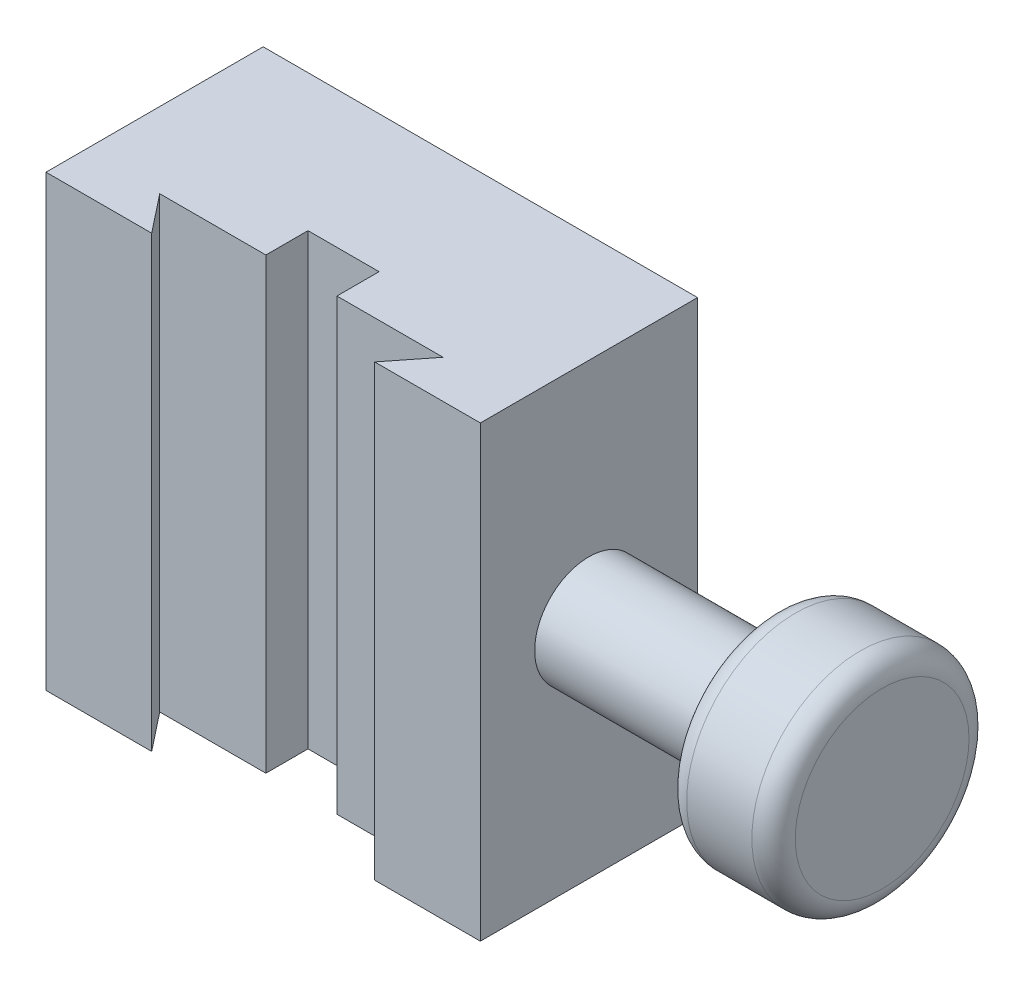
ISO-10303-21;
HEADER;
FILE_DESCRIPTION(('STEP AP214'),'2;1');
FILE_NAME('part.step','',(''),(''),'','','');
FILE_SCHEMA(('AUTOMOTIVE_DESIGN { 1 0 10303 214 1 1 1 1 }'));
ENDSEC;
DATA;
#1=APPLICATION_CONTEXT('core data for automotive mechanical design processes');
#2=APPLICATION_PROTOCOL_DEFINITION('international standard','automotive_design',2000,#1);
#3=PRODUCT_CONTEXT('',#1,'mechanical');
#4=PRODUCT('Part','Part','',(#3));
#5=PRODUCT_RELATED_PRODUCT_CATEGORY('part','',(#4));
#6=PRODUCT_DEFINITION_FORMATION('','',#4);
#7=PRODUCT_DEFINITION_CONTEXT('part definition',#1,'design');
#8=PRODUCT_DEFINITION('design','',#6,#7);
#9=PRODUCT_DEFINITION_SHAPE('','',#8);
#10=(LENGTH_UNIT() NAMED_UNIT(*) SI_UNIT(.MILLI.,.METRE.));
#11=(NAMED_UNIT(*) PLANE_ANGLE_UNIT() SI_UNIT($,.RADIAN.));
#12=(NAMED_UNIT(*) SI_UNIT($,.STERADIAN.) SOLID_ANGLE_UNIT());
#13=UNCERTAINTY_MEASURE_WITH_UNIT(LENGTH_MEASURE(1.E-05),#10,'distance_accuracy_value','');
#14=(GEOMETRIC_REPRESENTATION_CONTEXT(3) GLOBAL_UNCERTAINTY_ASSIGNED_CONTEXT((#13)) GLOBAL_UNIT_ASSIGNED_CONTEXT((#10,
#11,#12)) REPRESENTATION_CONTEXT('',''));
#15=CARTESIAN_POINT('',(0.,0.,0.));
#16=DIRECTION('',(0.,0.,1.));
#17=DIRECTION('',(1.,0.,0.));
#18=AXIS2_PLACEMENT_3D('',#15,#16,#17);
#19=CARTESIAN_POINT('',(0.,0.,30.));
#20=DIRECTION('',(0.,0.,1.));
#21=DIRECTION('',(1.,0.,0.));
#22=AXIS2_PLACEMENT_3D('',#19,#20,#21);
#23=PLANE('',#22);
#24=DIRECTION('',(0.,-1.,0.));
#25=VECTOR('',#24,1.);
#26=CARTESIAN_POINT('',(-15.4,31.,30.));
#27=LINE('',#26,#25);
#28=CARTESIAN_POINT('',(-15.4,31.,30.));
#29=VERTEX_POINT('',#28);
#30=CARTESIAN_POINT('',(-15.4,-31.,30.));
#31=VERTEX_POINT('',#30);
#32=EDGE_CURVE('E216',#29,#31,#27,.T.);
#33=ORIENTED_EDGE('',*,*,#32,.F.);
#34=DIRECTION('',(1.,0.,0.));
#35=VECTOR('',#34,1.);
#36=CARTESIAN_POINT('',(-30.,31.,30.));
#37=LINE('',#36,#35);
#38=CARTESIAN_POINT('',(-30.,31.,30.));
#39=VERTEX_POINT('',#38);
#40=EDGE_CURVE('E286',#39,#29,#37,.T.);
#41=ORIENTED_EDGE('',*,*,#40,.F.);
#42=DIRECTION('',(0.,1.,0.));
#43=VECTOR('',#42,1.);
#44=CARTESIAN_POINT('',(-30.,-31.,30.));
#45=LINE('',#44,#43);
#46=CARTESIAN_POINT('',(-30.,-31.,30.));
#47=VERTEX_POINT('',#46);
#48=EDGE_CURVE('E294',#47,#39,#45,.T.);
#49=ORIENTED_EDGE('',*,*,#48,.F.);
#50=DIRECTION('',(1.,0.,0.));
#51=VECTOR('',#50,1.);
#52=CARTESIAN_POINT('',(-30.,-31.,30.));
#53=LINE('',#52,#51);
#54=EDGE_CURVE('E291',#47,#31,#53,.T.);
#55=ORIENTED_EDGE('',*,*,#54,.T.);
#56=EDGE_LOOP('',(#33,#41,#49,#55));
#57=FACE_BOUND('',#56,.T.);
#58=ADVANCED_FACE('F36',(#57),#23,.T.);
#59=CARTESIAN_POINT('',(-30.,31.,30.));
#60=DIRECTION('',(0.,1.,0.));
#61=DIRECTION('',(0.,0.,1.));
#62=AXIS2_PLACEMENT_3D('',#59,#60,#61);
#63=PLANE('',#62);
#64=DIRECTION('',(-0.619788850318609,0.,-0.784768616230757));
#65=VECTOR('',#64,1.);
#66=CARTESIAN_POINT('',(-19.57,31.,24.72));
#67=LINE('',#66,#65);
#68=CARTESIAN_POINT('',(-19.57,31.,24.72));
#69=VERTEX_POINT('',#68);
#70=EDGE_CURVE('E196',#29,#69,#67,.T.);
#71=ORIENTED_EDGE('',*,*,#70,.T.);
#72=DIRECTION('',(1.,0.,0.));
#73=VECTOR('',#72,1.);
#74=CARTESIAN_POINT('',(-4.91,31.,24.72));
#75=LINE('',#74,#73);
#76=CARTESIAN_POINT('',(-4.91,31.,24.72));
#77=VERTEX_POINT('',#76);
#78=EDGE_CURVE('E172',#69,#77,#75,.T.);
#79=ORIENTED_EDGE('',*,*,#78,.T.);
#80=DIRECTION('',(0.,0.,-1.));
#81=VECTOR('',#80,1.);
#82=CARTESIAN_POINT('',(-4.91,31.,24.72));
#83=LINE('',#82,#81);
#84=CARTESIAN_POINT('',(-4.91,31.,18.9));
#85=VERTEX_POINT('',#84);
#86=EDGE_CURVE('E164',#77,#85,#83,.T.);
#87=ORIENTED_EDGE('',*,*,#86,.T.);
#88=DIRECTION('',(1.,0.,0.));
#89=VECTOR('',#88,1.);
#90=CARTESIAN_POINT('',(4.91,31.,18.9));
#91=LINE('',#90,#89);
#92=CARTESIAN_POINT('',(4.91,31.,18.9));
#93=VERTEX_POINT('',#92);
#94=EDGE_CURVE('E175',#85,#93,#91,.T.);
#95=ORIENTED_EDGE('',*,*,#94,.T.);
#96=DIRECTION('',(0.,0.,1.));
#97=VECTOR('',#96,1.);
#98=CARTESIAN_POINT('',(4.91,31.,24.72));
#99=LINE('',#98,#97);
#100=CARTESIAN_POINT('',(4.91,31.,24.72));
#101=VERTEX_POINT('',#100);
#102=EDGE_CURVE('E179',#93,#101,#99,.T.);
#103=ORIENTED_EDGE('',*,*,#102,.T.);
#104=DIRECTION('',(1.,0.,0.));
#105=VECTOR('',#104,1.);
#106=CARTESIAN_POINT('',(4.91,31.,24.72));
#107=LINE('',#106,#105);
#108=CARTESIAN_POINT('',(19.5699999999998,31.,24.7200000000001));
#109=VERTEX_POINT('',#108);
#110=EDGE_CURVE('E191',#101,#109,#107,.T.);
#111=ORIENTED_EDGE('',*,*,#110,.T.);
#112=DIRECTION('',(-0.619788850318615,0.,0.784768616230752));
#113=VECTOR('',#112,1.);
#114=CARTESIAN_POINT('',(19.5699999999998,31.,24.7200000000001));
#115=LINE('',#114,#113);
#116=CARTESIAN_POINT('',(15.3999999999997,31.,30.0000000000001));
#117=VERTEX_POINT('',#116);
#118=EDGE_CURVE('E194',#109,#117,#115,.T.);
#119=ORIENTED_EDGE('',*,*,#118,.T.);
#120=CARTESIAN_POINT('',(30.,31.,30.));
#121=VERTEX_POINT('',#120);
#122=EDGE_CURVE('E85',#117,#121,#37,.T.);
#123=ORIENTED_EDGE('',*,*,#122,.T.);
#124=DIRECTION('',(0.,0.,-1.));
#125=VECTOR('',#124,1.);
#126=CARTESIAN_POINT('',(30.,31.,30.));
#127=LINE('',#126,#125);
#128=CARTESIAN_POINT('',(30.,31.,0.));
#129=VERTEX_POINT('',#128);
#130=EDGE_CURVE('E296',#121,#129,#127,.T.);
#131=ORIENTED_EDGE('',*,*,#130,.T.);
#132=DIRECTION('',(1.,0.,0.));
#133=VECTOR('',#132,1.);
#134=CARTESIAN_POINT('',(-30.,31.,0.));
#135=LINE('',#134,#133);
#136=CARTESIAN_POINT('',(-30.,31.,0.));
#137=VERTEX_POINT('',#136);
#138=EDGE_CURVE('E281',#137,#129,#135,.T.);
#139=ORIENTED_EDGE('',*,*,#138,.F.);
#140=DIRECTION('',(0.,0.,-1.));
#141=VECTOR('',#140,1.);
#142=CARTESIAN_POINT('',(-30.,31.,30.));
#143=LINE('',#142,#141);
#144=EDGE_CURVE('E60',#39,#137,#143,.T.);
#145=ORIENTED_EDGE('',*,*,#144,.F.);
#146=ORIENTED_EDGE('',*,*,#40,.T.);
#147=EDGE_LOOP('',(#71,#79,#87,#95,#103,#111,#119,#123,#131,#139,#145,#146));
#148=FACE_BOUND('',#147,.T.);
#149=ADVANCED_FACE('F182',(#148),#63,.T.);
#150=CARTESIAN_POINT('',(-30.,-31.,30.));
#151=DIRECTION('',(-1.,0.,0.));
#152=DIRECTION('',(0.,0.,1.));
#153=AXIS2_PLACEMENT_3D('',#150,#151,#152);
#154=PLANE('',#153);
#155=DIRECTION('',(0.,1.,0.));
#156=VECTOR('',#155,1.);
#157=CARTESIAN_POINT('',(-30.,-31.,0.));
#158=LINE('',#157,#156);
#159=CARTESIAN_POINT('',(-30.,-31.,0.));
#160=VERTEX_POINT('',#159);
#161=EDGE_CURVE('E305',#160,#137,#158,.T.);
#162=ORIENTED_EDGE('',*,*,#161,.F.);
#163=DIRECTION('',(0.,0.,-1.));
#164=VECTOR('',#163,1.);
#165=CARTESIAN_POINT('',(-30.,-31.,30.));
#166=LINE('',#165,#164);
#167=EDGE_CURVE('E309',#47,#160,#166,.T.);
#168=ORIENTED_EDGE('',*,*,#167,.F.);
#169=ORIENTED_EDGE('',*,*,#48,.T.);
#170=ORIENTED_EDGE('',*,*,#144,.T.);
#171=EDGE_LOOP('',(#162,#168,#169,#170));
#172=FACE_BOUND('',#171,.T.);
#173=ADVANCED_FACE('F356',(#172),#154,.T.);
#174=CARTESIAN_POINT('',(-30.,-31.,30.));
#175=DIRECTION('',(0.,1.,0.));
#176=DIRECTION('',(0.,0.,1.));
#177=AXIS2_PLACEMENT_3D('',#174,#175,#176);
#178=PLANE('',#177);
#179=DIRECTION('',(1.,0.,0.));
#180=VECTOR('',#179,1.);
#181=CARTESIAN_POINT('',(-4.91,-31.,24.72));
#182=LINE('',#181,#180);
#183=CARTESIAN_POINT('',(-19.57,-31.,24.72));
#184=VERTEX_POINT('',#183);
#185=CARTESIAN_POINT('',(-4.91,-31.,24.72));
#186=VERTEX_POINT('',#185);
#187=EDGE_CURVE('E184',#184,#186,#182,.T.);
#188=ORIENTED_EDGE('',*,*,#187,.F.);
#189=DIRECTION('',(-0.619788850318609,0.,-0.784768616230757));
#190=VECTOR('',#189,1.);
#191=CARTESIAN_POINT('',(-19.57,-31.,24.72));
#192=LINE('',#191,#190);
#193=EDGE_CURVE('E187',#31,#184,#192,.T.);
#194=ORIENTED_EDGE('',*,*,#193,.F.);
#195=ORIENTED_EDGE('',*,*,#54,.F.);
#196=ORIENTED_EDGE('',*,*,#167,.T.);
#197=DIRECTION('',(1.,0.,0.));
#198=VECTOR('',#197,1.);
#199=CARTESIAN_POINT('',(-30.,-31.,0.));
#200=LINE('',#199,#198);
#201=CARTESIAN_POINT('',(30.,-31.,0.));
#202=VERTEX_POINT('',#201);
#203=EDGE_CURVE('E302',#160,#202,#200,.T.);
#204=ORIENTED_EDGE('',*,*,#203,.T.);
#205=DIRECTION('',(0.,0.,-1.));
#206=VECTOR('',#205,1.);
#207=CARTESIAN_POINT('',(30.,-31.,30.));
#208=LINE('',#207,#206);
#209=CARTESIAN_POINT('',(30.,-31.,30.));
#210=VERTEX_POINT('',#209);
#211=EDGE_CURVE('E311',#210,#202,#208,.T.);
#212=ORIENTED_EDGE('',*,*,#211,.F.);
#213=CARTESIAN_POINT('',(15.3999999999998,-31.,30.));
#214=VERTEX_POINT('',#213);
#215=EDGE_CURVE('E290',#214,#210,#53,.T.);
#216=ORIENTED_EDGE('',*,*,#215,.F.);
#217=DIRECTION('',(-0.619788850318615,0.,0.784768616230752));
#218=VECTOR('',#217,1.);
#219=CARTESIAN_POINT('',(19.5699999999998,-31.,24.7200000000001));
#220=LINE('',#219,#218);
#221=CARTESIAN_POINT('',(19.5699999999998,-31.,24.7200000000001));
#222=VERTEX_POINT('',#221);
#223=EDGE_CURVE('E51',#222,#214,#220,.T.);
#224=ORIENTED_EDGE('',*,*,#223,.F.);
#225=DIRECTION('',(1.,0.,0.));
#226=VECTOR('',#225,1.);
#227=CARTESIAN_POINT('',(4.91,-31.,24.72));
#228=LINE('',#227,#226);
#229=CARTESIAN_POINT('',(4.91,-31.,24.72));
#230=VERTEX_POINT('',#229);
#231=EDGE_CURVE('E205',#230,#222,#228,.T.);
#232=ORIENTED_EDGE('',*,*,#231,.F.);
#233=DIRECTION('',(0.,0.,1.));
#234=VECTOR('',#233,1.);
#235=CARTESIAN_POINT('',(4.91,-31.,24.72));
#236=LINE('',#235,#234);
#237=CARTESIAN_POINT('',(4.91,-31.,18.9));
#238=VERTEX_POINT('',#237);
#239=EDGE_CURVE('E202',#238,#230,#236,.T.);
#240=ORIENTED_EDGE('',*,*,#239,.F.);
#241=DIRECTION('',(1.,0.,0.));
#242=VECTOR('',#241,1.);
#243=CARTESIAN_POINT('',(4.91,-31.,18.9));
#244=LINE('',#243,#242);
#245=CARTESIAN_POINT('',(-4.91,-31.,18.9));
#246=VERTEX_POINT('',#245);
#247=EDGE_CURVE('E200',#246,#238,#244,.T.);
#248=ORIENTED_EDGE('',*,*,#247,.F.);
#249=DIRECTION('',(0.,0.,-1.));
#250=VECTOR('',#249,1.);
#251=CARTESIAN_POINT('',(-4.91,-31.,24.72));
#252=LINE('',#251,#250);
#253=EDGE_CURVE('E167',#186,#246,#252,.T.);
#254=ORIENTED_EDGE('',*,*,#253,.F.);
#255=EDGE_LOOP('',(#188,#194,#195,#196,#204,#212,#216,#224,#232,#240,#248,#254));
#256=FACE_BOUND('',#255,.T.);
#257=ADVANCED_FACE('F370',(#256),#178,.F.);
#258=CARTESIAN_POINT('',(30.,-31.,30.));
#259=DIRECTION('',(-1.,0.,0.));
#260=DIRECTION('',(0.,0.,1.));
#261=AXIS2_PLACEMENT_3D('',#258,#259,#260);
#262=PLANE('',#261);
#263=CARTESIAN_POINT('',(30.,0.,15.));
#264=DIRECTION('',(1.,0.,0.));
#265=DIRECTION('',(0.,0.,-1.));
#266=AXIS2_PLACEMENT_3D('',#263,#264,#265);
#267=CIRCLE('',#266,7.5);
#268=CARTESIAN_POINT('',(30.,0.,7.5));
#269=VERTEX_POINT('',#268);
#270=EDGE_CURVE('E282',#269,#269,#267,.T.);
#271=ORIENTED_EDGE('',*,*,#270,.F.);
#272=EDGE_LOOP('',(#271));
#273=FACE_BOUND('',#272,.T.);
#274=DIRECTION('',(0.,1.,0.));
#275=VECTOR('',#274,1.);
#276=CARTESIAN_POINT('',(30.,-31.,0.));
#277=LINE('',#276,#275);
#278=EDGE_CURVE('E299',#202,#129,#277,.T.);
#279=ORIENTED_EDGE('',*,*,#278,.T.);
#280=ORIENTED_EDGE('',*,*,#130,.F.);
#281=DIRECTION('',(0.,1.,0.));
#282=VECTOR('',#281,1.);
#283=CARTESIAN_POINT('',(30.,-31.,30.));
#284=LINE('',#283,#282);
#285=EDGE_CURVE('E288',#210,#121,#284,.T.);
#286=ORIENTED_EDGE('',*,*,#285,.F.);
#287=ORIENTED_EDGE('',*,*,#211,.T.);
#288=EDGE_LOOP('',(#279,#280,#286,#287));
#289=FACE_BOUND('',#288,.T.);
#290=ADVANCED_FACE('F363',(#273,#289),#262,.F.);
#291=DIRECTION('',(0.,-1.,0.));
#292=VECTOR('',#291,1.);
#293=CARTESIAN_POINT('',(15.3999999999997,31.,30.0000000000001));
#294=LINE('',#293,#292);
#295=EDGE_CURVE('E218',#117,#214,#294,.T.);
#296=ORIENTED_EDGE('',*,*,#295,.T.);
#297=ORIENTED_EDGE('',*,*,#215,.T.);
#298=ORIENTED_EDGE('',*,*,#285,.T.);
#299=ORIENTED_EDGE('',*,*,#122,.F.);
#300=EDGE_LOOP('',(#296,#297,#298,#299));
#301=FACE_BOUND('',#300,.T.);
#302=ADVANCED_FACE('F352',(#301),#23,.T.);
#303=CARTESIAN_POINT('',(0.,0.,0.));
#304=DIRECTION('',(0.,0.,1.));
#305=DIRECTION('',(1.,0.,0.));
#306=AXIS2_PLACEMENT_3D('',#303,#304,#305);
#307=PLANE('',#306);
#308=CARTESIAN_POINT('',(12.7,12.7,0.));
#309=DIRECTION('',(0.,0.,-1.));
#310=DIRECTION('',(-1.,0.,0.));
#311=AXIS2_PLACEMENT_3D('',#308,#309,#310);
#312=CIRCLE('',#311,2.5527);
#313=CARTESIAN_POINT('',(10.1473,12.7,0.));
#314=VERTEX_POINT('',#313);
#315=EDGE_CURVE('E213',#314,#314,#312,.T.);
#316=ORIENTED_EDGE('',*,*,#315,.F.);
#317=EDGE_LOOP('',(#316));
#318=FACE_BOUND('',#317,.T.);
#319=CARTESIAN_POINT('',(0.,0.,0.));
#320=DIRECTION('',(0.,0.,-1.));
#321=DIRECTION('',(-1.,0.,0.));
#322=AXIS2_PLACEMENT_3D('',#319,#320,#321);
#323=CIRCLE('',#322,2.5527);
#324=CARTESIAN_POINT('',(-2.5527,0.,0.));
#325=VERTEX_POINT('',#324);
#326=EDGE_CURVE('E230',#325,#325,#323,.T.);
#327=ORIENTED_EDGE('',*,*,#326,.F.);
#328=EDGE_LOOP('',(#327));
#329=FACE_BOUND('',#328,.T.);
#330=CARTESIAN_POINT('',(-12.7,12.7,0.));
#331=DIRECTION('',(0.,0.,-1.));
#332=DIRECTION('',(-1.,0.,0.));
#333=AXIS2_PLACEMENT_3D('',#330,#331,#332);
#334=CIRCLE('',#333,2.5527);
#335=CARTESIAN_POINT('',(-15.2527,12.7,0.));
#336=VERTEX_POINT('',#335);
#337=EDGE_CURVE('E236',#336,#336,#334,.T.);
#338=ORIENTED_EDGE('',*,*,#337,.F.);
#339=EDGE_LOOP('',(#338));
#340=FACE_BOUND('',#339,.T.);
#341=CARTESIAN_POINT('',(-12.7,-12.7,0.));
#342=DIRECTION('',(0.,0.,-1.));
#343=DIRECTION('',(-1.,0.,0.));
#344=AXIS2_PLACEMENT_3D('',#341,#342,#343);
#345=CIRCLE('',#344,2.5527);
#346=CARTESIAN_POINT('',(-15.2527,-12.7,0.));
#347=VERTEX_POINT('',#346);
#348=EDGE_CURVE('E242',#347,#347,#345,.T.);
#349=ORIENTED_EDGE('',*,*,#348,.F.);
#350=EDGE_LOOP('',(#349));
#351=FACE_BOUND('',#350,.T.);
#352=CARTESIAN_POINT('',(12.7,-12.7,0.));
#353=DIRECTION('',(0.,0.,-1.));
#354=DIRECTION('',(-1.,0.,0.));
#355=AXIS2_PLACEMENT_3D('',#352,#353,#354);
#356=CIRCLE('',#355,2.5527);
#357=CARTESIAN_POINT('',(10.1473,-12.7,0.));
#358=VERTEX_POINT('',#357);
#359=EDGE_CURVE('E248',#358,#358,#356,.T.);
#360=ORIENTED_EDGE('',*,*,#359,.F.);
#361=EDGE_LOOP('',(#360));
#362=FACE_BOUND('',#361,.T.);
#363=CARTESIAN_POINT('',(25.4,25.4,0.));
#364=DIRECTION('',(0.,0.,-1.));
#365=DIRECTION('',(-1.,0.,0.));
#366=AXIS2_PLACEMENT_3D('',#363,#364,#365);
#367=CIRCLE('',#366,2.5527);
#368=CARTESIAN_POINT('',(22.8473,25.4,0.));
#369=VERTEX_POINT('',#368);
#370=EDGE_CURVE('E254',#369,#369,#367,.T.);
#371=ORIENTED_EDGE('',*,*,#370,.F.);
#372=EDGE_LOOP('',(#371));
#373=FACE_BOUND('',#372,.T.);
#374=CARTESIAN_POINT('',(-25.4,25.4,0.));
#375=DIRECTION('',(0.,0.,-1.));
#376=DIRECTION('',(-1.,0.,0.));
#377=AXIS2_PLACEMENT_3D('',#374,#375,#376);
#378=CIRCLE('',#377,2.5527);
#379=CARTESIAN_POINT('',(-27.9527,25.4,0.));
#380=VERTEX_POINT('',#379);
#381=EDGE_CURVE('E260',#380,#380,#378,.T.);
#382=ORIENTED_EDGE('',*,*,#381,.F.);
#383=EDGE_LOOP('',(#382));
#384=FACE_BOUND('',#383,.T.);
#385=CARTESIAN_POINT('',(-25.4,-25.4,0.));
#386=DIRECTION('',(0.,0.,-1.));
#387=DIRECTION('',(-1.,0.,0.));
#388=AXIS2_PLACEMENT_3D('',#385,#386,#387);
#389=CIRCLE('',#388,2.5527);
#390=CARTESIAN_POINT('',(-27.9527,-25.4,0.));
#391=VERTEX_POINT('',#390);
#392=EDGE_CURVE('E266',#391,#391,#389,.T.);
#393=ORIENTED_EDGE('',*,*,#392,.F.);
#394=EDGE_LOOP('',(#393));
#395=FACE_BOUND('',#394,.T.);
#396=CARTESIAN_POINT('',(25.4,-25.4,0.));
#397=DIRECTION('',(0.,0.,-1.));
#398=DIRECTION('',(-1.,0.,0.));
#399=AXIS2_PLACEMENT_3D('',#396,#397,#398);
#400=CIRCLE('',#399,2.5527);
#401=CARTESIAN_POINT('',(22.8473,-25.4,0.));
#402=VERTEX_POINT('',#401);
#403=EDGE_CURVE('E272',#402,#402,#400,.T.);
#404=ORIENTED_EDGE('',*,*,#403,.F.);
#405=EDGE_LOOP('',(#404));
#406=FACE_BOUND('',#405,.T.);
#407=ORIENTED_EDGE('',*,*,#138,.T.);
#408=ORIENTED_EDGE('',*,*,#278,.F.);
#409=ORIENTED_EDGE('',*,*,#203,.F.);
#410=ORIENTED_EDGE('',*,*,#161,.T.);
#411=EDGE_LOOP('',(#407,#408,#409,#410));
#412=FACE_BOUND('',#411,.T.);
#413=ADVANCED_FACE('F362',(#318,#329,#340,#351,#362,#373,#384,#395,#406,#412),#307,.F.);
#414=CARTESIAN_POINT('',(55.5,0.,15.));
#415=DIRECTION('',(-1.,0.,0.));
#416=DIRECTION('',(0.,0.,1.));
#417=AXIS2_PLACEMENT_3D('',#414,#415,#416);
#418=CYLINDRICAL_SURFACE('',#417,7.5);
#419=CARTESIAN_POINT('',(55.5,0.,15.));
#420=DIRECTION('',(1.,0.,0.));
#421=DIRECTION('',(0.,0.,-1.));
#422=AXIS2_PLACEMENT_3D('',#419,#420,#421);
#423=CIRCLE('',#422,7.5);
#424=CARTESIAN_POINT('',(55.5,0.,7.5));
#425=VERTEX_POINT('',#424);
#426=EDGE_CURVE('E278',#425,#425,#423,.T.);
#427=ORIENTED_EDGE('',*,*,#426,.F.);
#428=EDGE_LOOP('',(#427));
#429=FACE_BOUND('',#428,.T.);
#430=ORIENTED_EDGE('',*,*,#270,.T.);
#431=EDGE_LOOP('',(#430));
#432=FACE_BOUND('',#431,.T.);
#433=ADVANCED_FACE('F333',(#429,#432),#418,.T.);
#434=CARTESIAN_POINT('',(70.5,0.,15.));
#435=DIRECTION('',(-1.,0.,0.));
#436=DIRECTION('',(0.,0.,1.));
#437=AXIS2_PLACEMENT_3D('',#434,#435,#436);
#438=CYLINDRICAL_SURFACE('',#437,15.);
#439=CARTESIAN_POINT('',(58.5,0.,15.));
#440=DIRECTION('',(1.,0.,0.));
#441=DIRECTION('',(0.,0.,-1.));
#442=AXIS2_PLACEMENT_3D('',#439,#440,#441);
#443=CIRCLE('',#442,15.);
#444=CARTESIAN_POINT('',(58.5,0.,0.));
#445=VERTEX_POINT('',#444);
#446=EDGE_CURVE('E316',#445,#445,#443,.T.);
#447=ORIENTED_EDGE('',*,*,#446,.T.);
#448=EDGE_LOOP('',(#447));
#449=FACE_BOUND('',#448,.T.);
#450=CARTESIAN_POINT('',(67.5,0.,15.));
#451=DIRECTION('',(1.,0.,0.));
#452=DIRECTION('',(0.,0.,-1.));
#453=AXIS2_PLACEMENT_3D('',#450,#451,#452);
#454=CIRCLE('',#453,15.);
#455=CARTESIAN_POINT('',(67.5,0.,0.));
#456=VERTEX_POINT('',#455);
#457=EDGE_CURVE('E285',#456,#456,#454,.F.);
#458=ORIENTED_EDGE('',*,*,#457,.T.);
#459=EDGE_LOOP('',(#458));
#460=FACE_BOUND('',#459,.T.);
#461=ADVANCED_FACE('F329',(#449,#460),#438,.T.);
#462=CARTESIAN_POINT('',(70.5,0.,15.));
#463=DIRECTION('',(1.,0.,0.));
#464=DIRECTION('',(0.,0.,-1.));
#465=AXIS2_PLACEMENT_3D('',#462,#463,#464);
#466=PLANE('',#465);
#467=CARTESIAN_POINT('',(70.5,0.,15.));
#468=DIRECTION('',(1.,0.,0.));
#469=DIRECTION('',(0.,0.,-1.));
#470=AXIS2_PLACEMENT_3D('',#467,#468,#469);
#471=CIRCLE('',#470,12.);
#472=CARTESIAN_POINT('',(70.5,0.,3.));
#473=VERTEX_POINT('',#472);
#474=EDGE_CURVE('E11',#473,#473,#471,.T.);
#475=ORIENTED_EDGE('',*,*,#474,.T.);
#476=EDGE_LOOP('',(#475));
#477=FACE_BOUND('',#476,.T.);
#478=ADVANCED_FACE('F332',(#477),#466,.T.);
#479=CARTESIAN_POINT('',(55.5,0.,15.));
#480=DIRECTION('',(1.,0.,0.));
#481=DIRECTION('',(0.,0.,-1.));
#482=AXIS2_PLACEMENT_3D('',#479,#480,#481);
#483=PLANE('',#482);
#484=CARTESIAN_POINT('',(55.5,0.,15.));
#485=DIRECTION('',(1.,0.,0.));
#486=DIRECTION('',(0.,0.,-1.));
#487=AXIS2_PLACEMENT_3D('',#484,#485,#486);
#488=CIRCLE('',#487,12.);
#489=CARTESIAN_POINT('',(55.5,0.,3.));
#490=VERTEX_POINT('',#489);
#491=EDGE_CURVE('E44',#490,#490,#488,.F.);
#492=ORIENTED_EDGE('',*,*,#491,.T.);
#493=EDGE_LOOP('',(#492));
#494=FACE_BOUND('',#493,.T.);
#495=ORIENTED_EDGE('',*,*,#426,.T.);
#496=EDGE_LOOP('',(#495));
#497=FACE_BOUND('',#496,.T.);
#498=ADVANCED_FACE('F321',(#494,#497),#483,.F.);
#499=CARTESIAN_POINT('',(58.5,0.,15.));
#500=DIRECTION('',(1.,0.,0.));
#501=DIRECTION('',(0.,0.,-1.));
#502=AXIS2_PLACEMENT_3D('',#499,#500,#501);
#503=TOROIDAL_SURFACE('',#502,12.,3.);
#504=ORIENTED_EDGE('',*,*,#491,.F.);
#505=EDGE_LOOP('',(#504));
#506=FACE_BOUND('',#505,.T.);
#507=ORIENTED_EDGE('',*,*,#446,.F.);
#508=EDGE_LOOP('',(#507));
#509=FACE_BOUND('',#508,.T.);
#510=ADVANCED_FACE('F324',(#506,#509),#503,.T.);
#511=CARTESIAN_POINT('',(67.5,0.,15.));
#512=DIRECTION('',(1.,0.,0.));
#513=DIRECTION('',(0.,0.,-1.));
#514=AXIS2_PLACEMENT_3D('',#511,#512,#513);
#515=TOROIDAL_SURFACE('',#514,12.,3.);
#516=ORIENTED_EDGE('',*,*,#457,.F.);
#517=EDGE_LOOP('',(#516));
#518=FACE_BOUND('',#517,.T.);
#519=ORIENTED_EDGE('',*,*,#474,.F.);
#520=EDGE_LOOP('',(#519));
#521=FACE_BOUND('',#520,.T.);
#522=ADVANCED_FACE('F38',(#518,#521),#515,.T.);
#523=CARTESIAN_POINT('',(25.4,-25.4,16.51));
#524=DIRECTION('',(0.,0.,-1.));
#525=DIRECTION('',(-1.,0.,0.));
#526=AXIS2_PLACEMENT_3D('',#523,#524,#525);
#527=CONICAL_SURFACE('',#526,2.5527,1.02974425867665);
#528=CARTESIAN_POINT('',(25.4,-25.4,18.0438169021917));
#529=VERTEX_POINT('',#528);
#530=VERTEX_LOOP('',#529);
#531=FACE_BOUND('',#530,.T.);
#532=CARTESIAN_POINT('',(25.4,-25.4,16.51));
#533=DIRECTION('',(0.,0.,-1.));
#534=DIRECTION('',(-1.,0.,0.));
#535=AXIS2_PLACEMENT_3D('',#532,#533,#534);
#536=CIRCLE('',#535,2.5527);
#537=CARTESIAN_POINT('',(22.8473,-25.4,16.51));
#538=VERTEX_POINT('',#537);
#539=EDGE_CURVE('E275',#538,#538,#536,.T.);
#540=ORIENTED_EDGE('',*,*,#539,.T.);
#541=EDGE_LOOP('',(#540));
#542=FACE_BOUND('',#541,.T.);
#543=ADVANCED_FACE('F339',(#531,#542),#527,.F.);
#544=CARTESIAN_POINT('',(25.4,-25.4,0.));
#545=DIRECTION('',(0.,0.,-1.));
#546=DIRECTION('',(-1.,0.,0.));
#547=AXIS2_PLACEMENT_3D('',#544,#545,#546);
#548=CYLINDRICAL_SURFACE('',#547,2.5527);
#549=ORIENTED_EDGE('',*,*,#539,.F.);
#550=EDGE_LOOP('',(#549));
#551=FACE_BOUND('',#550,.T.);
#552=ORIENTED_EDGE('',*,*,#403,.T.);
#553=EDGE_LOOP('',(#552));
#554=FACE_BOUND('',#553,.T.);
#555=ADVANCED_FACE('F478',(#551,#554),#548,.F.);
#556=CARTESIAN_POINT('',(-25.4,-25.4,16.51));
#557=DIRECTION('',(0.,0.,-1.));
#558=DIRECTION('',(-1.,0.,0.));
#559=AXIS2_PLACEMENT_3D('',#556,#557,#558);
#560=CONICAL_SURFACE('',#559,2.5527,1.02974425867665);
#561=CARTESIAN_POINT('',(-25.4,-25.4,18.0438169021917));
#562=VERTEX_POINT('',#561);
#563=VERTEX_LOOP('',#562);
#564=FACE_BOUND('',#563,.T.);
#565=CARTESIAN_POINT('',(-25.4,-25.4,16.51));
#566=DIRECTION('',(0.,0.,-1.));
#567=DIRECTION('',(-1.,0.,0.));
#568=AXIS2_PLACEMENT_3D('',#565,#566,#567);
#569=CIRCLE('',#568,2.5527);
#570=CARTESIAN_POINT('',(-27.9527,-25.4,16.51));
#571=VERTEX_POINT('',#570);
#572=EDGE_CURVE('E269',#571,#571,#569,.T.);
#573=ORIENTED_EDGE('',*,*,#572,.T.);
#574=EDGE_LOOP('',(#573));
#575=FACE_BOUND('',#574,.T.);
#576=ADVANCED_FACE('F474',(#564,#575),#560,.F.);
#577=CARTESIAN_POINT('',(-25.4,-25.4,0.));
#578=DIRECTION('',(0.,0.,-1.));
#579=DIRECTION('',(-1.,0.,0.));
#580=AXIS2_PLACEMENT_3D('',#577,#578,#579);
#581=CYLINDRICAL_SURFACE('',#580,2.5527);
#582=ORIENTED_EDGE('',*,*,#572,.F.);
#583=EDGE_LOOP('',(#582));
#584=FACE_BOUND('',#583,.T.);
#585=ORIENTED_EDGE('',*,*,#392,.T.);
#586=EDGE_LOOP('',(#585));
#587=FACE_BOUND('',#586,.T.);
#588=ADVANCED_FACE('F470',(#584,#587),#581,.F.);
#589=CARTESIAN_POINT('',(-25.4,25.4,16.51));
#590=DIRECTION('',(0.,0.,-1.));
#591=DIRECTION('',(-1.,0.,0.));
#592=AXIS2_PLACEMENT_3D('',#589,#590,#591);
#593=CONICAL_SURFACE('',#592,2.5527,1.02974425867665);
#594=CARTESIAN_POINT('',(-25.4,25.4,18.0438169021917));
#595=VERTEX_POINT('',#594);
#596=VERTEX_LOOP('',#595);
#597=FACE_BOUND('',#596,.T.);
#598=CARTESIAN_POINT('',(-25.4,25.4,16.51));
#599=DIRECTION('',(0.,0.,-1.));
#600=DIRECTION('',(-1.,0.,0.));
#601=AXIS2_PLACEMENT_3D('',#598,#599,#600);
#602=CIRCLE('',#601,2.5527);
#603=CARTESIAN_POINT('',(-27.9527,25.4,16.51));
#604=VERTEX_POINT('',#603);
#605=EDGE_CURVE('E263',#604,#604,#602,.T.);
#606=ORIENTED_EDGE('',*,*,#605,.T.);
#607=EDGE_LOOP('',(#606));
#608=FACE_BOUND('',#607,.T.);
#609=ADVANCED_FACE('F466',(#597,#608),#593,.F.);
#610=CARTESIAN_POINT('',(-25.4,25.4,0.));
#611=DIRECTION('',(0.,0.,-1.));
#612=DIRECTION('',(-1.,0.,0.));
#613=AXIS2_PLACEMENT_3D('',#610,#611,#612);
#614=CYLINDRICAL_SURFACE('',#613,2.5527);
#615=ORIENTED_EDGE('',*,*,#605,.F.);
#616=EDGE_LOOP('',(#615));
#617=FACE_BOUND('',#616,.T.);
#618=ORIENTED_EDGE('',*,*,#381,.T.);
#619=EDGE_LOOP('',(#618));
#620=FACE_BOUND('',#619,.T.);
#621=ADVANCED_FACE('F462',(#617,#620),#614,.F.);
#622=CARTESIAN_POINT('',(25.4,25.4,16.51));
#623=DIRECTION('',(0.,0.,-1.));
#624=DIRECTION('',(-1.,0.,0.));
#625=AXIS2_PLACEMENT_3D('',#622,#623,#624);
#626=CONICAL_SURFACE('',#625,2.5527,1.02974425867665);
#627=CARTESIAN_POINT('',(25.4,25.4,18.0438169021917));
#628=VERTEX_POINT('',#627);
#629=VERTEX_LOOP('',#628);
#630=FACE_BOUND('',#629,.T.);
#631=CARTESIAN_POINT('',(25.4,25.4,16.51));
#632=DIRECTION('',(0.,0.,-1.));
#633=DIRECTION('',(-1.,0.,0.));
#634=AXIS2_PLACEMENT_3D('',#631,#632,#633);
#635=CIRCLE('',#634,2.5527);
#636=CARTESIAN_POINT('',(22.8473,25.4,16.51));
#637=VERTEX_POINT('',#636);
#638=EDGE_CURVE('E257',#637,#637,#635,.T.);
#639=ORIENTED_EDGE('',*,*,#638,.T.);
#640=EDGE_LOOP('',(#639));
#641=FACE_BOUND('',#640,.T.);
#642=ADVANCED_FACE('F458',(#630,#641),#626,.F.);
#643=CARTESIAN_POINT('',(25.4,25.4,0.));
#644=DIRECTION('',(0.,0.,-1.));
#645=DIRECTION('',(-1.,0.,0.));
#646=AXIS2_PLACEMENT_3D('',#643,#644,#645);
#647=CYLINDRICAL_SURFACE('',#646,2.5527);
#648=ORIENTED_EDGE('',*,*,#638,.F.);
#649=EDGE_LOOP('',(#648));
#650=FACE_BOUND('',#649,.T.);
#651=ORIENTED_EDGE('',*,*,#370,.T.);
#652=EDGE_LOOP('',(#651));
#653=FACE_BOUND('',#652,.T.);
#654=ADVANCED_FACE('F454',(#650,#653),#647,.F.);
#655=CARTESIAN_POINT('',(12.7,-12.7,16.51));
#656=DIRECTION('',(0.,0.,-1.));
#657=DIRECTION('',(-1.,0.,0.));
#658=AXIS2_PLACEMENT_3D('',#655,#656,#657);
#659=CONICAL_SURFACE('',#658,2.5527,1.02974425867665);
#660=CARTESIAN_POINT('',(12.7,-12.7,18.0438169021917));
#661=VERTEX_POINT('',#660);
#662=VERTEX_LOOP('',#661);
#663=FACE_BOUND('',#662,.T.);
#664=CARTESIAN_POINT('',(12.7,-12.7,16.51));
#665=DIRECTION('',(0.,0.,-1.));
#666=DIRECTION('',(-1.,0.,0.));
#667=AXIS2_PLACEMENT_3D('',#664,#665,#666);
#668=CIRCLE('',#667,2.5527);
#669=CARTESIAN_POINT('',(10.1473,-12.7,16.51));
#670=VERTEX_POINT('',#669);
#671=EDGE_CURVE('E251',#670,#670,#668,.T.);
#672=ORIENTED_EDGE('',*,*,#671,.T.);
#673=EDGE_LOOP('',(#672));
#674=FACE_BOUND('',#673,.T.);
#675=ADVANCED_FACE('F450',(#663,#674),#659,.F.);
#676=CARTESIAN_POINT('',(12.7,-12.7,0.));
#677=DIRECTION('',(0.,0.,-1.));
#678=DIRECTION('',(-1.,0.,0.));
#679=AXIS2_PLACEMENT_3D('',#676,#677,#678);
#680=CYLINDRICAL_SURFACE('',#679,2.5527);
#681=ORIENTED_EDGE('',*,*,#671,.F.);
#682=EDGE_LOOP('',(#681));
#683=FACE_BOUND('',#682,.T.);
#684=ORIENTED_EDGE('',*,*,#359,.T.);
#685=EDGE_LOOP('',(#684));
#686=FACE_BOUND('',#685,.T.);
#687=ADVANCED_FACE('F446',(#683,#686),#680,.F.);
#688=CARTESIAN_POINT('',(-12.7,-12.7,16.51));
#689=DIRECTION('',(0.,0.,-1.));
#690=DIRECTION('',(-1.,0.,0.));
#691=AXIS2_PLACEMENT_3D('',#688,#689,#690);
#692=CONICAL_SURFACE('',#691,2.5527,1.02974425867665);
#693=CARTESIAN_POINT('',(-12.7,-12.7,18.0438169021917));
#694=VERTEX_POINT('',#693);
#695=VERTEX_LOOP('',#694);
#696=FACE_BOUND('',#695,.T.);
#697=CARTESIAN_POINT('',(-12.7,-12.7,16.51));
#698=DIRECTION('',(0.,0.,-1.));
#699=DIRECTION('',(-1.,0.,0.));
#700=AXIS2_PLACEMENT_3D('',#697,#698,#699);
#701=CIRCLE('',#700,2.5527);
#702=CARTESIAN_POINT('',(-15.2527,-12.7,16.51));
#703=VERTEX_POINT('',#702);
#704=EDGE_CURVE('E245',#703,#703,#701,.T.);
#705=ORIENTED_EDGE('',*,*,#704,.T.);
#706=EDGE_LOOP('',(#705));
#707=FACE_BOUND('',#706,.T.);
#708=ADVANCED_FACE('F442',(#696,#707),#692,.F.);
#709=CARTESIAN_POINT('',(-12.7,-12.7,0.));
#710=DIRECTION('',(0.,0.,-1.));
#711=DIRECTION('',(-1.,0.,0.));
#712=AXIS2_PLACEMENT_3D('',#709,#710,#711);
#713=CYLINDRICAL_SURFACE('',#712,2.5527);
#714=ORIENTED_EDGE('',*,*,#704,.F.);
#715=EDGE_LOOP('',(#714));
#716=FACE_BOUND('',#715,.T.);
#717=ORIENTED_EDGE('',*,*,#348,.T.);
#718=EDGE_LOOP('',(#717));
#719=FACE_BOUND('',#718,.T.);
#720=ADVANCED_FACE('F438',(#716,#719),#713,.F.);
#721=CARTESIAN_POINT('',(-12.7,12.7,16.51));
#722=DIRECTION('',(0.,0.,-1.));
#723=DIRECTION('',(-1.,0.,0.));
#724=AXIS2_PLACEMENT_3D('',#721,#722,#723);
#725=CONICAL_SURFACE('',#724,2.5527,1.02974425867665);
#726=CARTESIAN_POINT('',(-12.7,12.7,18.0438169021917));
#727=VERTEX_POINT('',#726);
#728=VERTEX_LOOP('',#727);
#729=FACE_BOUND('',#728,.T.);
#730=CARTESIAN_POINT('',(-12.7,12.7,16.51));
#731=DIRECTION('',(0.,0.,-1.));
#732=DIRECTION('',(-1.,0.,0.));
#733=AXIS2_PLACEMENT_3D('',#730,#731,#732);
#734=CIRCLE('',#733,2.5527);
#735=CARTESIAN_POINT('',(-15.2527,12.7,16.51));
#736=VERTEX_POINT('',#735);
#737=EDGE_CURVE('E239',#736,#736,#734,.T.);
#738=ORIENTED_EDGE('',*,*,#737,.T.);
#739=EDGE_LOOP('',(#738));
#740=FACE_BOUND('',#739,.T.);
#741=ADVANCED_FACE('F434',(#729,#740),#725,.F.);
#742=CARTESIAN_POINT('',(-12.7,12.7,0.));
#743=DIRECTION('',(0.,0.,-1.));
#744=DIRECTION('',(-1.,0.,0.));
#745=AXIS2_PLACEMENT_3D('',#742,#743,#744);
#746=CYLINDRICAL_SURFACE('',#745,2.5527);
#747=ORIENTED_EDGE('',*,*,#737,.F.);
#748=EDGE_LOOP('',(#747));
#749=FACE_BOUND('',#748,.T.);
#750=ORIENTED_EDGE('',*,*,#337,.T.);
#751=EDGE_LOOP('',(#750));
#752=FACE_BOUND('',#751,.T.);
#753=ADVANCED_FACE('F430',(#749,#752),#746,.F.);
#754=CARTESIAN_POINT('',(0.,0.,16.51));
#755=DIRECTION('',(0.,0.,-1.));
#756=DIRECTION('',(-1.,0.,0.));
#757=AXIS2_PLACEMENT_3D('',#754,#755,#756);
#758=CONICAL_SURFACE('',#757,2.5527,1.02974425867665);
#759=CARTESIAN_POINT('',(0.,0.,18.0438169021917));
#760=VERTEX_POINT('',#759);
#761=VERTEX_LOOP('',#760);
#762=FACE_BOUND('',#761,.T.);
#763=CARTESIAN_POINT('',(0.,0.,16.51));
#764=DIRECTION('',(0.,0.,-1.));
#765=DIRECTION('',(-1.,0.,0.));
#766=AXIS2_PLACEMENT_3D('',#763,#764,#765);
#767=CIRCLE('',#766,2.5527);
#768=CARTESIAN_POINT('',(-2.5527,0.,16.51));
#769=VERTEX_POINT('',#768);
#770=EDGE_CURVE('E233',#769,#769,#767,.T.);
#771=ORIENTED_EDGE('',*,*,#770,.T.);
#772=EDGE_LOOP('',(#771));
#773=FACE_BOUND('',#772,.T.);
#774=ADVANCED_FACE('F426',(#762,#773),#758,.F.);
#775=CARTESIAN_POINT('',(0.,0.,0.));
#776=DIRECTION('',(0.,0.,-1.));
#777=DIRECTION('',(-1.,0.,0.));
#778=AXIS2_PLACEMENT_3D('',#775,#776,#777);
#779=CYLINDRICAL_SURFACE('',#778,2.5527);
#780=ORIENTED_EDGE('',*,*,#770,.F.);
#781=EDGE_LOOP('',(#780));
#782=FACE_BOUND('',#781,.T.);
#783=ORIENTED_EDGE('',*,*,#326,.T.);
#784=EDGE_LOOP('',(#783));
#785=FACE_BOUND('',#784,.T.);
#786=ADVANCED_FACE('F422',(#782,#785),#779,.F.);
#787=CARTESIAN_POINT('',(12.7,12.7,16.51));
#788=DIRECTION('',(0.,0.,-1.));
#789=DIRECTION('',(-1.,0.,0.));
#790=AXIS2_PLACEMENT_3D('',#787,#788,#789);
#791=CONICAL_SURFACE('',#790,2.5527,1.02974425867665);
#792=CARTESIAN_POINT('',(12.7,12.7,18.0438169021917));
#793=VERTEX_POINT('',#792);
#794=VERTEX_LOOP('',#793);
#795=FACE_BOUND('',#794,.T.);
#796=CARTESIAN_POINT('',(12.7,12.7,16.51));
#797=DIRECTION('',(0.,0.,-1.));
#798=DIRECTION('',(-1.,0.,0.));
#799=AXIS2_PLACEMENT_3D('',#796,#797,#798);
#800=CIRCLE('',#799,2.5527);
#801=CARTESIAN_POINT('',(10.1473,12.7,16.51));
#802=VERTEX_POINT('',#801);
#803=EDGE_CURVE('E227',#802,#802,#800,.T.);
#804=ORIENTED_EDGE('',*,*,#803,.T.);
#805=EDGE_LOOP('',(#804));
#806=FACE_BOUND('',#805,.T.);
#807=ADVANCED_FACE('F418',(#795,#806),#791,.F.);
#808=CARTESIAN_POINT('',(12.7,12.7,0.));
#809=DIRECTION('',(0.,0.,-1.));
#810=DIRECTION('',(-1.,0.,0.));
#811=AXIS2_PLACEMENT_3D('',#808,#809,#810);
#812=CYLINDRICAL_SURFACE('',#811,2.5527);
#813=ORIENTED_EDGE('',*,*,#803,.F.);
#814=EDGE_LOOP('',(#813));
#815=FACE_BOUND('',#814,.T.);
#816=ORIENTED_EDGE('',*,*,#315,.T.);
#817=EDGE_LOOP('',(#816));
#818=FACE_BOUND('',#817,.T.);
#819=ADVANCED_FACE('F415',(#815,#818),#812,.F.);
#820=CARTESIAN_POINT('',(-4.91,31.,24.72));
#821=DIRECTION('',(-1.,0.,0.));
#822=DIRECTION('',(0.,0.,1.));
#823=AXIS2_PLACEMENT_3D('',#820,#821,#822);
#824=PLANE('',#823);
#825=ORIENTED_EDGE('',*,*,#253,.T.);
#826=DIRECTION('',(0.,-1.,0.));
#827=VECTOR('',#826,1.);
#828=CARTESIAN_POINT('',(-4.91,31.,18.9));
#829=LINE('',#828,#827);
#830=EDGE_CURVE('E160',#85,#246,#829,.T.);
#831=ORIENTED_EDGE('',*,*,#830,.F.);
#832=ORIENTED_EDGE('',*,*,#86,.F.);
#833=DIRECTION('',(0.,-1.,0.));
#834=VECTOR('',#833,1.);
#835=CARTESIAN_POINT('',(-4.91,31.,24.72));
#836=LINE('',#835,#834);
#837=EDGE_CURVE('E211',#77,#186,#836,.T.);
#838=ORIENTED_EDGE('',*,*,#837,.T.);
#839=EDGE_LOOP('',(#825,#831,#832,#838));
#840=FACE_BOUND('',#839,.T.);
#841=ADVANCED_FACE('F162',(#840),#824,.F.);
#842=CARTESIAN_POINT('',(-4.91,31.,24.72));
#843=DIRECTION('',(0.,0.,-1.));
#844=DIRECTION('',(-1.,0.,0.));
#845=AXIS2_PLACEMENT_3D('',#842,#843,#844);
#846=PLANE('',#845);
#847=ORIENTED_EDGE('',*,*,#187,.T.);
#848=ORIENTED_EDGE('',*,*,#837,.F.);
#849=ORIENTED_EDGE('',*,*,#78,.F.);
#850=DIRECTION('',(0.,-1.,0.));
#851=VECTOR('',#850,1.);
#852=CARTESIAN_POINT('',(-19.57,31.,24.72));
#853=LINE('',#852,#851);
#854=EDGE_CURVE('E214',#69,#184,#853,.T.);
#855=ORIENTED_EDGE('',*,*,#854,.T.);
#856=EDGE_LOOP('',(#847,#848,#849,#855));
#857=FACE_BOUND('',#856,.T.);
#858=ADVANCED_FACE('F391',(#857),#846,.F.);
#859=CARTESIAN_POINT('',(-19.57,31.,24.72));
#860=DIRECTION('',(-0.784768616230757,0.,0.619788850318609));
#861=DIRECTION('',(0.619788850318609,0.,0.784768616230757));
#862=AXIS2_PLACEMENT_3D('',#859,#860,#861);
#863=PLANE('',#862);
#864=ORIENTED_EDGE('',*,*,#193,.T.);
#865=ORIENTED_EDGE('',*,*,#854,.F.);
#866=ORIENTED_EDGE('',*,*,#70,.F.);
#867=ORIENTED_EDGE('',*,*,#32,.T.);
#868=EDGE_LOOP('',(#864,#865,#866,#867));
#869=FACE_BOUND('',#868,.T.);
#870=ADVANCED_FACE('F389',(#869),#863,.F.);
#871=CARTESIAN_POINT('',(19.5699999999998,31.,24.7200000000001));
#872=DIRECTION('',(0.784768616230752,0.,0.619788850318615));
#873=DIRECTION('',(0.619788850318615,0.,-0.784768616230752));
#874=AXIS2_PLACEMENT_3D('',#871,#872,#873);
#875=PLANE('',#874);
#876=ORIENTED_EDGE('',*,*,#223,.T.);
#877=ORIENTED_EDGE('',*,*,#295,.F.);
#878=ORIENTED_EDGE('',*,*,#118,.F.);
#879=DIRECTION('',(0.,-1.,0.));
#880=VECTOR('',#879,1.);
#881=CARTESIAN_POINT('',(19.5699999999998,31.,24.7200000000001));
#882=LINE('',#881,#880);
#883=EDGE_CURVE('E220',#109,#222,#882,.T.);
#884=ORIENTED_EDGE('',*,*,#883,.T.);
#885=EDGE_LOOP('',(#876,#877,#878,#884));
#886=FACE_BOUND('',#885,.T.);
#887=ADVANCED_FACE('F398',(#886),#875,.F.);
#888=CARTESIAN_POINT('',(4.91,31.,24.72));
#889=DIRECTION('',(0.,0.,-1.));
#890=DIRECTION('',(-1.,0.,0.));
#891=AXIS2_PLACEMENT_3D('',#888,#889,#890);
#892=PLANE('',#891);
#893=ORIENTED_EDGE('',*,*,#231,.T.);
#894=ORIENTED_EDGE('',*,*,#883,.F.);
#895=ORIENTED_EDGE('',*,*,#110,.F.);
#896=DIRECTION('',(0.,-1.,0.));
#897=VECTOR('',#896,1.);
#898=CARTESIAN_POINT('',(4.91,31.,24.72));
#899=LINE('',#898,#897);
#900=EDGE_CURVE('E222',#101,#230,#899,.T.);
#901=ORIENTED_EDGE('',*,*,#900,.T.);
#902=EDGE_LOOP('',(#893,#894,#895,#901));
#903=FACE_BOUND('',#902,.T.);
#904=ADVANCED_FACE('F397',(#903),#892,.F.);
#905=CARTESIAN_POINT('',(4.91,31.,24.72));
#906=DIRECTION('',(1.,0.,0.));
#907=DIRECTION('',(0.,0.,-1.));
#908=AXIS2_PLACEMENT_3D('',#905,#906,#907);
#909=PLANE('',#908);
#910=ORIENTED_EDGE('',*,*,#239,.T.);
#911=ORIENTED_EDGE('',*,*,#900,.F.);
#912=ORIENTED_EDGE('',*,*,#102,.F.);
#913=DIRECTION('',(0.,-1.,0.));
#914=VECTOR('',#913,1.);
#915=CARTESIAN_POINT('',(4.91,31.,18.9));
#916=LINE('',#915,#914);
#917=EDGE_CURVE('E171',#93,#238,#916,.T.);
#918=ORIENTED_EDGE('',*,*,#917,.T.);
#919=EDGE_LOOP('',(#910,#911,#912,#918));
#920=FACE_BOUND('',#919,.T.);
#921=ADVANCED_FACE('F394',(#920),#909,.F.);
#922=CARTESIAN_POINT('',(4.91,31.,18.9));
#923=DIRECTION('',(0.,0.,-1.));
#924=DIRECTION('',(-1.,0.,0.));
#925=AXIS2_PLACEMENT_3D('',#922,#923,#924);
#926=PLANE('',#925);
#927=ORIENTED_EDGE('',*,*,#247,.T.);
#928=ORIENTED_EDGE('',*,*,#917,.F.);
#929=ORIENTED_EDGE('',*,*,#94,.F.);
#930=ORIENTED_EDGE('',*,*,#830,.T.);
#931=EDGE_LOOP('',(#927,#928,#929,#930));
#932=FACE_BOUND('',#931,.T.);
#933=ADVANCED_FACE('F176',(#932),#926,.F.);
#934=CLOSED_SHELL('',(#58,#149,#173,#257,#290,#302,#413,#433,#461,#478,#498,#510,#522,#543,#555,
#576,#588,#609,#621,#642,#654,#675,#687,#708,#720,#741,#753,#774,#786,#807,#819,#841,#858,#870,
#887,#904,#921,#933));
#935=MANIFOLD_SOLID_BREP('B2',#934);
#936=ADVANCED_BREP_SHAPE_REPRESENTATION('',(#18,#935),#14);
#937=SHAPE_DEFINITION_REPRESENTATION(#9,#936);
ENDSEC;
END-ISO-10303-21;
